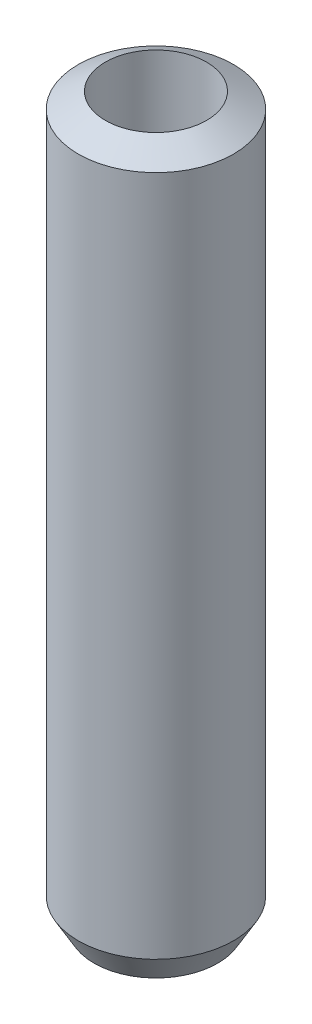
ISO-10303-21;
HEADER;
FILE_DESCRIPTION(('STEP AP214'),'2;1');
FILE_NAME('part.step','',(''),(''),'','','');
FILE_SCHEMA(('AUTOMOTIVE_DESIGN { 1 0 10303 214 1 1 1 1 }'));
ENDSEC;
DATA;
#1=APPLICATION_CONTEXT('core data for automotive mechanical design processes');
#2=APPLICATION_PROTOCOL_DEFINITION('international standard','automotive_design',2000,#1);
#3=PRODUCT_CONTEXT('',#1,'mechanical');
#4=PRODUCT('Part','Part','',(#3));
#5=PRODUCT_RELATED_PRODUCT_CATEGORY('part','',(#4));
#6=PRODUCT_DEFINITION_FORMATION('','',#4);
#7=PRODUCT_DEFINITION_CONTEXT('part definition',#1,'design');
#8=PRODUCT_DEFINITION('design','',#6,#7);
#9=PRODUCT_DEFINITION_SHAPE('','',#8);
#10=(LENGTH_UNIT() NAMED_UNIT(*) SI_UNIT(.MILLI.,.METRE.));
#11=(NAMED_UNIT(*) PLANE_ANGLE_UNIT() SI_UNIT($,.RADIAN.));
#12=(NAMED_UNIT(*) SI_UNIT($,.STERADIAN.) SOLID_ANGLE_UNIT());
#13=UNCERTAINTY_MEASURE_WITH_UNIT(LENGTH_MEASURE(1.E-05),#10,'distance_accuracy_value','');
#14=(GEOMETRIC_REPRESENTATION_CONTEXT(3) GLOBAL_UNCERTAINTY_ASSIGNED_CONTEXT((#13)) GLOBAL_UNIT_ASSIGNED_CONTEXT((#10,
#11,#12)) REPRESENTATION_CONTEXT('',''));
#15=CARTESIAN_POINT('',(0.,0.,0.));
#16=DIRECTION('',(0.,0.,1.));
#17=DIRECTION('',(1.,0.,0.));
#18=AXIS2_PLACEMENT_3D('',#15,#16,#17);
#19=CARTESIAN_POINT('',(0.,69.9773456031402,0.));
#20=DIRECTION('',(0.,-1.,0.));
#21=DIRECTION('',(0.,0.,-1.));
#22=AXIS2_PLACEMENT_3D('',#19,#20,#21);
#23=CYLINDRICAL_SURFACE('',#22,7.5);
#24=CARTESIAN_POINT('',(0.,68.4527300922382,0.));
#25=DIRECTION('',(0.,1.,0.));
#26=DIRECTION('',(0.,0.,1.));
#27=AXIS2_PLACEMENT_3D('',#24,#25,#26);
#28=CIRCLE('',#27,7.5);
#29=CARTESIAN_POINT('',(0.,68.4527300922382,7.5));
#30=VERTEX_POINT('',#29);
#31=EDGE_CURVE('E50',#30,#30,#28,.F.);
#32=ORIENTED_EDGE('',*,*,#31,.T.);
#33=EDGE_LOOP('',(#32));
#34=FACE_BOUND('',#33,.T.);
#35=CARTESIAN_POINT('',(0.,2.64071152688984,0.));
#36=DIRECTION('',(0.,1.,0.));
#37=DIRECTION('',(0.,0.,1.));
#38=AXIS2_PLACEMENT_3D('',#35,#36,#37);
#39=CIRCLE('',#38,7.5);
#40=CARTESIAN_POINT('',(0.,2.64071152688984,7.5));
#41=VERTEX_POINT('',#40);
#42=EDGE_CURVE('E51',#41,#41,#39,.T.);
#43=ORIENTED_EDGE('',*,*,#42,.T.);
#44=EDGE_LOOP('',(#43));
#45=FACE_BOUND('',#44,.T.);
#46=ADVANCED_FACE('F39',(#34,#45),#23,.T.);
#47=CARTESIAN_POINT('',(0.,0.,0.));
#48=DIRECTION('',(0.,1.,0.));
#49=DIRECTION('',(0.,0.,1.));
#50=AXIS2_PLACEMENT_3D('',#47,#48,#49);
#51=PLANE('',#50);
#52=CARTESIAN_POINT('',(0.,0.,0.));
#53=DIRECTION('',(0.,1.,0.));
#54=DIRECTION('',(0.,0.,1.));
#55=AXIS2_PLACEMENT_3D('',#52,#53,#54);
#56=CIRCLE('',#55,5.975384489098);
#57=CARTESIAN_POINT('',(0.,0.,5.975384489098));
#58=VERTEX_POINT('',#57);
#59=EDGE_CURVE('E10',#58,#58,#56,.F.);
#60=ORIENTED_EDGE('',*,*,#59,.T.);
#61=EDGE_LOOP('',(#60));
#62=FACE_BOUND('',#61,.T.);
#63=CARTESIAN_POINT('',(0.,0.,0.));
#64=DIRECTION('',(0.,1.,0.));
#65=DIRECTION('',(0.,0.,1.));
#66=AXIS2_PLACEMENT_3D('',#63,#64,#65);
#67=CIRCLE('',#66,4.88777122403453);
#68=CARTESIAN_POINT('',(0.,0.,4.88777122403453));
#69=VERTEX_POINT('',#68);
#70=EDGE_CURVE('E58',#69,#69,#67,.T.);
#71=ORIENTED_EDGE('',*,*,#70,.T.);
#72=EDGE_LOOP('',(#71));
#73=FACE_BOUND('',#72,.T.);
#74=ADVANCED_FACE('F62',(#62,#73),#51,.F.);
#75=CARTESIAN_POINT('',(0.,69.9773456031402,0.));
#76=DIRECTION('',(0.,-1.,0.));
#77=DIRECTION('',(0.,0.,-1.));
#78=AXIS2_PLACEMENT_3D('',#75,#76,#77);
#79=CYLINDRICAL_SURFACE('',#78,4.88777122403453);
#80=CARTESIAN_POINT('',(0.,69.9609010792267,0.));
#81=DIRECTION('',(0.,-1.,0.));
#82=DIRECTION('',(0.,0.,-1.));
#83=AXIS2_PLACEMENT_3D('',#80,#81,#82);
#84=CIRCLE('',#83,4.88777122403453);
#85=CARTESIAN_POINT('',(0.,69.9609010792267,-4.88777122403453));
#86=VERTEX_POINT('',#85);
#87=EDGE_CURVE('E54',#86,#86,#84,.F.);
#88=ORIENTED_EDGE('',*,*,#87,.T.);
#89=EDGE_LOOP('',(#88));
#90=FACE_BOUND('',#89,.T.);
#91=ORIENTED_EDGE('',*,*,#70,.F.);
#92=EDGE_LOOP('',(#91));
#93=FACE_BOUND('',#92,.T.);
#94=ADVANCED_FACE('F68',(#90,#93),#79,.F.);
#95=CARTESIAN_POINT('',(0.,69.9773456031402,0.));
#96=DIRECTION('',(0.,-1.,0.));
#97=DIRECTION('',(0.,0.,-1.));
#98=AXIS2_PLACEMENT_3D('',#95,#96,#97);
#99=CONICAL_SURFACE('',#98,4.85928847311011,1.0471975511966);
#100=ORIENTED_EDGE('',*,*,#31,.F.);
#101=EDGE_LOOP('',(#100));
#102=FACE_BOUND('',#101,.T.);
#103=ORIENTED_EDGE('',*,*,#87,.F.);
#104=EDGE_LOOP('',(#103));
#105=FACE_BOUND('',#104,.T.);
#106=ADVANCED_FACE('F66',(#102,#105),#99,.T.);
#107=CARTESIAN_POINT('',(0.,2.64071152688984,0.));
#108=DIRECTION('',(0.,1.,0.));
#109=DIRECTION('',(0.,0.,1.));
#110=AXIS2_PLACEMENT_3D('',#107,#108,#109);
#111=CONICAL_SURFACE('',#110,7.5,0.523598775598301);
#112=ORIENTED_EDGE('',*,*,#59,.F.);
#113=EDGE_LOOP('',(#112));
#114=FACE_BOUND('',#113,.T.);
#115=ORIENTED_EDGE('',*,*,#42,.F.);
#116=EDGE_LOOP('',(#115));
#117=FACE_BOUND('',#116,.T.);
#118=ADVANCED_FACE('F45',(#114,#117),#111,.T.);
#119=CLOSED_SHELL('',(#46,#74,#94,#106,#118));
#120=MANIFOLD_SOLID_BREP('B2',#119);
#121=ADVANCED_BREP_SHAPE_REPRESENTATION('',(#18,#120),#14);
#122=SHAPE_DEFINITION_REPRESENTATION(#9,#121);
ENDSEC;
END-ISO-10303-21;
